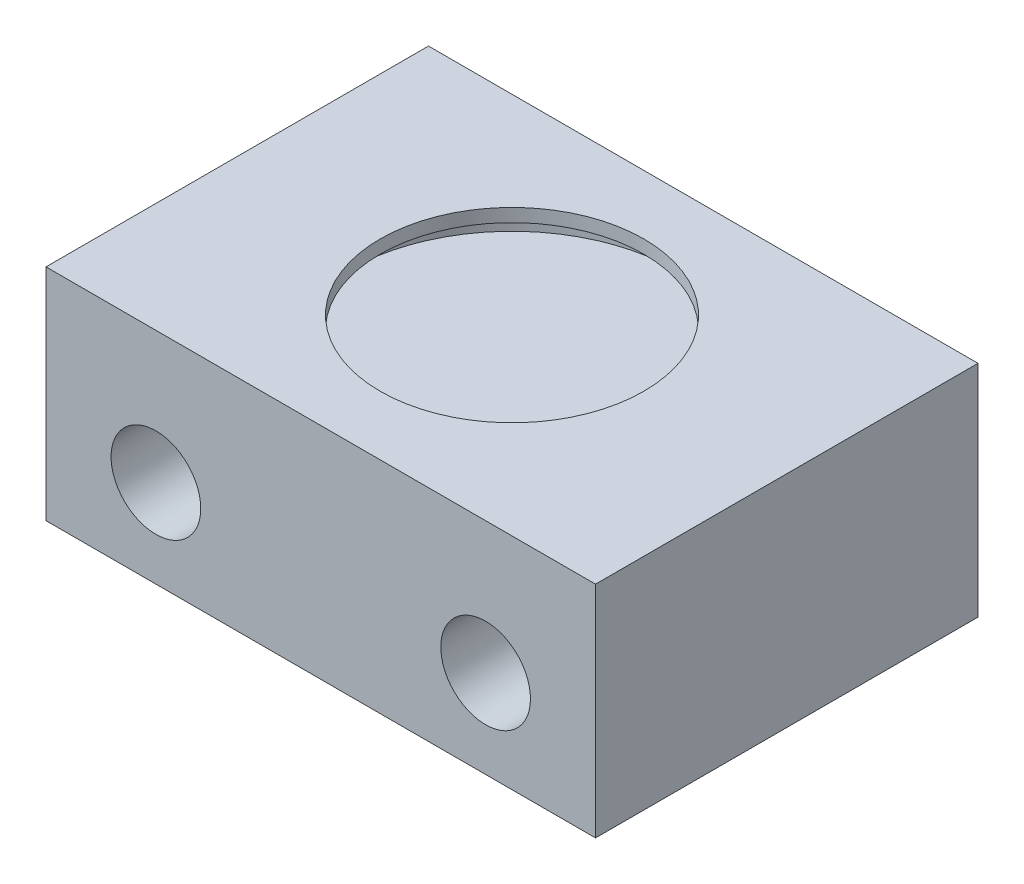
ISO-10303-21;
HEADER;
FILE_DESCRIPTION(('STEP AP214'),'2;1');
FILE_NAME('part.step','',(''),(''),'','','');
FILE_SCHEMA(('AUTOMOTIVE_DESIGN { 1 0 10303 214 1 1 1 1 }'));
ENDSEC;
DATA;
#1=APPLICATION_CONTEXT('core data for automotive mechanical design processes');
#2=APPLICATION_PROTOCOL_DEFINITION('international standard','automotive_design',2000,#1);
#3=PRODUCT_CONTEXT('',#1,'mechanical');
#4=PRODUCT('Part','Part','',(#3));
#5=PRODUCT_RELATED_PRODUCT_CATEGORY('part','',(#4));
#6=PRODUCT_DEFINITION_FORMATION('','',#4);
#7=PRODUCT_DEFINITION_CONTEXT('part definition',#1,'design');
#8=PRODUCT_DEFINITION('design','',#6,#7);
#9=PRODUCT_DEFINITION_SHAPE('','',#8);
#10=(LENGTH_UNIT() NAMED_UNIT(*) SI_UNIT(.MILLI.,.METRE.));
#11=(NAMED_UNIT(*) PLANE_ANGLE_UNIT() SI_UNIT($,.RADIAN.));
#12=(NAMED_UNIT(*) SI_UNIT($,.STERADIAN.) SOLID_ANGLE_UNIT());
#13=UNCERTAINTY_MEASURE_WITH_UNIT(LENGTH_MEASURE(1.E-05),#10,'distance_accuracy_value','');
#14=(GEOMETRIC_REPRESENTATION_CONTEXT(3) GLOBAL_UNCERTAINTY_ASSIGNED_CONTEXT((#13)) GLOBAL_UNIT_ASSIGNED_CONTEXT((#10,
#11,#12)) REPRESENTATION_CONTEXT('',''));
#15=CARTESIAN_POINT('',(0.,0.,0.));
#16=DIRECTION('',(0.,0.,1.));
#17=DIRECTION('',(1.,0.,0.));
#18=AXIS2_PLACEMENT_3D('',#15,#16,#17);
#19=CARTESIAN_POINT('',(15.875,12.7,-11.049));
#20=DIRECTION('',(-1.,0.,0.));
#21=DIRECTION('',(0.,0.,1.));
#22=AXIS2_PLACEMENT_3D('',#19,#20,#21);
#23=PLANE('',#22);
#24=DIRECTION('',(0.,0.,-1.));
#25=VECTOR('',#24,1.);
#26=CARTESIAN_POINT('',(15.875,0.,-11.049));
#27=LINE('',#26,#25);
#28=CARTESIAN_POINT('',(15.875,0.,11.049));
#29=VERTEX_POINT('',#28);
#30=CARTESIAN_POINT('',(15.875,0.,-11.049));
#31=VERTEX_POINT('',#30);
#32=EDGE_CURVE('E97',#29,#31,#27,.T.);
#33=ORIENTED_EDGE('',*,*,#32,.T.);
#34=DIRECTION('',(0.,-1.,0.));
#35=VECTOR('',#34,1.);
#36=CARTESIAN_POINT('',(15.875,12.7,-11.049));
#37=LINE('',#36,#35);
#38=CARTESIAN_POINT('',(15.875,12.7,-11.049));
#39=VERTEX_POINT('',#38);
#40=EDGE_CURVE('E11',#39,#31,#37,.T.);
#41=ORIENTED_EDGE('',*,*,#40,.F.);
#42=DIRECTION('',(0.,0.,-1.));
#43=VECTOR('',#42,1.);
#44=CARTESIAN_POINT('',(15.875,12.7,-11.049));
#45=LINE('',#44,#43);
#46=CARTESIAN_POINT('',(15.875,12.7,11.049));
#47=VERTEX_POINT('',#46);
#48=EDGE_CURVE('E85',#47,#39,#45,.T.);
#49=ORIENTED_EDGE('',*,*,#48,.F.);
#50=DIRECTION('',(0.,-1.,0.));
#51=VECTOR('',#50,1.);
#52=CARTESIAN_POINT('',(15.875,12.7,11.049));
#53=LINE('',#52,#51);
#54=EDGE_CURVE('E93',#47,#29,#53,.T.);
#55=ORIENTED_EDGE('',*,*,#54,.T.);
#56=EDGE_LOOP('',(#33,#41,#49,#55));
#57=FACE_BOUND('',#56,.T.);
#58=ADVANCED_FACE('F34',(#57),#23,.F.);
#59=CARTESIAN_POINT('',(-15.875,12.7,-11.049));
#60=DIRECTION('',(0.,0.,1.));
#61=DIRECTION('',(1.,0.,0.));
#62=AXIS2_PLACEMENT_3D('',#59,#60,#61);
#63=PLANE('',#62);
#64=CARTESIAN_POINT('',(-9.525,5.08,-11.049));
#65=DIRECTION('',(0.,0.,1.));
#66=DIRECTION('',(1.,0.,0.));
#67=AXIS2_PLACEMENT_3D('',#64,#65,#66);
#68=CIRCLE('',#67,2.5908);
#69=CARTESIAN_POINT('',(-6.93420000000001,5.08,-11.049));
#70=VERTEX_POINT('',#69);
#71=EDGE_CURVE('E122',#70,#70,#68,.T.);
#72=ORIENTED_EDGE('',*,*,#71,.T.);
#73=EDGE_LOOP('',(#72));
#74=FACE_BOUND('',#73,.T.);
#75=CARTESIAN_POINT('',(9.525,5.08,-11.049));
#76=DIRECTION('',(0.,0.,1.));
#77=DIRECTION('',(1.,0.,0.));
#78=AXIS2_PLACEMENT_3D('',#75,#76,#77);
#79=CIRCLE('',#78,2.5908);
#80=CARTESIAN_POINT('',(12.1158,5.08,-11.049));
#81=VERTEX_POINT('',#80);
#82=EDGE_CURVE('E114',#81,#81,#79,.T.);
#83=ORIENTED_EDGE('',*,*,#82,.T.);
#84=EDGE_LOOP('',(#83));
#85=FACE_BOUND('',#84,.T.);
#86=DIRECTION('',(-1.,0.,0.));
#87=VECTOR('',#86,1.);
#88=CARTESIAN_POINT('',(-15.875,0.,-11.049));
#89=LINE('',#88,#87);
#90=CARTESIAN_POINT('',(-15.875,0.,-11.049));
#91=VERTEX_POINT('',#90);
#92=EDGE_CURVE('E89',#31,#91,#89,.T.);
#93=ORIENTED_EDGE('',*,*,#92,.T.);
#94=DIRECTION('',(0.,-1.,0.));
#95=VECTOR('',#94,1.);
#96=CARTESIAN_POINT('',(-15.875,12.7,-11.049));
#97=LINE('',#96,#95);
#98=CARTESIAN_POINT('',(-15.875,12.7,-11.049));
#99=VERTEX_POINT('',#98);
#100=EDGE_CURVE('E42',#99,#91,#97,.T.);
#101=ORIENTED_EDGE('',*,*,#100,.F.);
#102=DIRECTION('',(-1.,0.,0.));
#103=VECTOR('',#102,1.);
#104=CARTESIAN_POINT('',(-15.875,12.7,-11.049));
#105=LINE('',#104,#103);
#106=EDGE_CURVE('E80',#39,#99,#105,.T.);
#107=ORIENTED_EDGE('',*,*,#106,.F.);
#108=ORIENTED_EDGE('',*,*,#40,.T.);
#109=EDGE_LOOP('',(#93,#101,#107,#108));
#110=FACE_BOUND('',#109,.T.);
#111=ADVANCED_FACE('F88',(#74,#85,#110),#63,.F.);
#112=CARTESIAN_POINT('',(-15.875,12.7,-11.049));
#113=DIRECTION('',(1.,0.,0.));
#114=DIRECTION('',(0.,0.,-1.));
#115=AXIS2_PLACEMENT_3D('',#112,#113,#114);
#116=PLANE('',#115);
#117=DIRECTION('',(0.,0.,1.));
#118=VECTOR('',#117,1.);
#119=CARTESIAN_POINT('',(-15.875,0.,-11.049));
#120=LINE('',#119,#118);
#121=CARTESIAN_POINT('',(-15.875,0.,11.049));
#122=VERTEX_POINT('',#121);
#123=EDGE_CURVE('E67',#91,#122,#120,.T.);
#124=ORIENTED_EDGE('',*,*,#123,.T.);
#125=DIRECTION('',(0.,-1.,0.));
#126=VECTOR('',#125,1.);
#127=CARTESIAN_POINT('',(-15.875,12.7,11.049));
#128=LINE('',#127,#126);
#129=CARTESIAN_POINT('',(-15.875,12.7,11.049));
#130=VERTEX_POINT('',#129);
#131=EDGE_CURVE('E90',#130,#122,#128,.T.);
#132=ORIENTED_EDGE('',*,*,#131,.F.);
#133=DIRECTION('',(0.,0.,1.));
#134=VECTOR('',#133,1.);
#135=CARTESIAN_POINT('',(-15.875,12.7,-11.049));
#136=LINE('',#135,#134);
#137=EDGE_CURVE('E83',#99,#130,#136,.T.);
#138=ORIENTED_EDGE('',*,*,#137,.F.);
#139=ORIENTED_EDGE('',*,*,#100,.T.);
#140=EDGE_LOOP('',(#124,#132,#138,#139));
#141=FACE_BOUND('',#140,.T.);
#142=ADVANCED_FACE('F91',(#141),#116,.F.);
#143=CARTESIAN_POINT('',(-15.875,12.7,11.049));
#144=DIRECTION('',(0.,0.,-1.));
#145=DIRECTION('',(-1.,0.,0.));
#146=AXIS2_PLACEMENT_3D('',#143,#144,#145);
#147=PLANE('',#146);
#148=CARTESIAN_POINT('',(-9.525,5.08,11.049));
#149=DIRECTION('',(0.,0.,1.));
#150=DIRECTION('',(1.,0.,0.));
#151=AXIS2_PLACEMENT_3D('',#148,#149,#150);
#152=CIRCLE('',#151,2.5908);
#153=CARTESIAN_POINT('',(-6.9342,5.08,11.049));
#154=VERTEX_POINT('',#153);
#155=EDGE_CURVE('E125',#154,#154,#152,.T.);
#156=ORIENTED_EDGE('',*,*,#155,.F.);
#157=EDGE_LOOP('',(#156));
#158=FACE_BOUND('',#157,.T.);
#159=CARTESIAN_POINT('',(9.525,5.08,11.049));
#160=DIRECTION('',(0.,0.,1.));
#161=DIRECTION('',(1.,0.,0.));
#162=AXIS2_PLACEMENT_3D('',#159,#160,#161);
#163=CIRCLE('',#162,2.5908);
#164=CARTESIAN_POINT('',(12.1158,5.08,11.049));
#165=VERTEX_POINT('',#164);
#166=EDGE_CURVE('E119',#165,#165,#163,.T.);
#167=ORIENTED_EDGE('',*,*,#166,.F.);
#168=EDGE_LOOP('',(#167));
#169=FACE_BOUND('',#168,.T.);
#170=DIRECTION('',(1.,0.,0.));
#171=VECTOR('',#170,1.);
#172=CARTESIAN_POINT('',(-15.875,0.,11.049));
#173=LINE('',#172,#171);
#174=EDGE_CURVE('E73',#122,#29,#173,.T.);
#175=ORIENTED_EDGE('',*,*,#174,.T.);
#176=ORIENTED_EDGE('',*,*,#54,.F.);
#177=DIRECTION('',(1.,0.,0.));
#178=VECTOR('',#177,1.);
#179=CARTESIAN_POINT('',(-15.875,12.7,11.049));
#180=LINE('',#179,#178);
#181=EDGE_CURVE('E50',#130,#47,#180,.T.);
#182=ORIENTED_EDGE('',*,*,#181,.F.);
#183=ORIENTED_EDGE('',*,*,#131,.T.);
#184=EDGE_LOOP('',(#175,#176,#182,#183));
#185=FACE_BOUND('',#184,.T.);
#186=ADVANCED_FACE('F105',(#158,#169,#185),#147,.F.);
#187=CARTESIAN_POINT('',(0.,12.7,0.));
#188=DIRECTION('',(0.,1.,0.));
#189=DIRECTION('',(0.,0.,1.));
#190=AXIS2_PLACEMENT_3D('',#187,#188,#189);
#191=PLANE('',#190);
#192=CARTESIAN_POINT('',(0.,12.7,0.));
#193=DIRECTION('',(0.,1.,0.));
#194=DIRECTION('',(0.,0.,1.));
#195=AXIS2_PLACEMENT_3D('',#192,#193,#194);
#196=CIRCLE('',#195,7.62);
#197=CARTESIAN_POINT('',(0.,12.7,7.62));
#198=VERTEX_POINT('',#197);
#199=EDGE_CURVE('E128',#198,#198,#196,.T.);
#200=ORIENTED_EDGE('',*,*,#199,.F.);
#201=EDGE_LOOP('',(#200));
#202=FACE_BOUND('',#201,.T.);
#203=ORIENTED_EDGE('',*,*,#48,.T.);
#204=ORIENTED_EDGE('',*,*,#106,.T.);
#205=ORIENTED_EDGE('',*,*,#137,.T.);
#206=ORIENTED_EDGE('',*,*,#181,.T.);
#207=EDGE_LOOP('',(#203,#204,#205,#206));
#208=FACE_BOUND('',#207,.T.);
#209=ADVANCED_FACE('F81',(#202,#208),#191,.T.);
#210=CARTESIAN_POINT('',(0.,0.,0.));
#211=DIRECTION('',(0.,1.,0.));
#212=DIRECTION('',(0.,0.,1.));
#213=AXIS2_PLACEMENT_3D('',#210,#211,#212);
#214=PLANE('',#213);
#215=ORIENTED_EDGE('',*,*,#32,.F.);
#216=ORIENTED_EDGE('',*,*,#174,.F.);
#217=ORIENTED_EDGE('',*,*,#123,.F.);
#218=ORIENTED_EDGE('',*,*,#92,.F.);
#219=EDGE_LOOP('',(#215,#216,#217,#218));
#220=FACE_BOUND('',#219,.T.);
#221=ADVANCED_FACE('F108',(#220),#214,.F.);
#222=CARTESIAN_POINT('',(9.525,5.08,11.049));
#223=DIRECTION('',(0.,0.,1.));
#224=DIRECTION('',(1.,0.,0.));
#225=AXIS2_PLACEMENT_3D('',#222,#223,#224);
#226=CYLINDRICAL_SURFACE('',#225,2.5908);
#227=ORIENTED_EDGE('',*,*,#82,.F.);
#228=EDGE_LOOP('',(#227));
#229=FACE_BOUND('',#228,.T.);
#230=ORIENTED_EDGE('',*,*,#166,.T.);
#231=EDGE_LOOP('',(#230));
#232=FACE_BOUND('',#231,.T.);
#233=ADVANCED_FACE('F170',(#229,#232),#226,.F.);
#234=CARTESIAN_POINT('',(-9.525,5.08,11.049));
#235=DIRECTION('',(0.,0.,1.));
#236=DIRECTION('',(1.,0.,0.));
#237=AXIS2_PLACEMENT_3D('',#234,#235,#236);
#238=CYLINDRICAL_SURFACE('',#237,2.5908);
#239=ORIENTED_EDGE('',*,*,#71,.F.);
#240=EDGE_LOOP('',(#239));
#241=FACE_BOUND('',#240,.T.);
#242=ORIENTED_EDGE('',*,*,#155,.T.);
#243=EDGE_LOOP('',(#242));
#244=FACE_BOUND('',#243,.T.);
#245=ADVANCED_FACE('F178',(#241,#244),#238,.F.);
#246=CARTESIAN_POINT('',(0.,-0.000999999999999265,0.));
#247=DIRECTION('',(0.,1.,0.));
#248=DIRECTION('',(0.,0.,1.));
#249=AXIS2_PLACEMENT_3D('',#246,#247,#248);
#250=CYLINDRICAL_SURFACE('',#249,7.62);
#251=ORIENTED_EDGE('',*,*,#199,.T.);
#252=EDGE_LOOP('',(#251));
#253=FACE_BOUND('',#252,.T.);
#254=CARTESIAN_POINT('',(0.,11.938,0.));
#255=DIRECTION('',(0.,1.,0.));
#256=DIRECTION('',(0.,0.,1.));
#257=AXIS2_PLACEMENT_3D('',#254,#255,#256);
#258=CIRCLE('',#257,7.62);
#259=CARTESIAN_POINT('',(0.,11.938,7.62));
#260=VERTEX_POINT('',#259);
#261=EDGE_CURVE('E131',#260,#260,#258,.F.);
#262=ORIENTED_EDGE('',*,*,#261,.T.);
#263=EDGE_LOOP('',(#262));
#264=FACE_BOUND('',#263,.T.);
#265=ADVANCED_FACE('F135',(#253,#264),#250,.F.);
#266=CARTESIAN_POINT('',(0.,11.938,0.));
#267=DIRECTION('',(0.,-1.,0.));
#268=DIRECTION('',(0.,0.,-1.));
#269=AXIS2_PLACEMENT_3D('',#266,#267,#268);
#270=CYLINDRICAL_SURFACE('',#269,9.525);
#271=CARTESIAN_POINT('',(0.,11.938,0.));
#272=DIRECTION('',(0.,1.,0.));
#273=DIRECTION('',(0.,0.,1.));
#274=AXIS2_PLACEMENT_3D('',#271,#272,#273);
#275=CIRCLE('',#274,9.525);
#276=CARTESIAN_POINT('',(0.,11.938,9.525));
#277=VERTEX_POINT('',#276);
#278=EDGE_CURVE('E100',#277,#277,#275,.T.);
#279=ORIENTED_EDGE('',*,*,#278,.T.);
#280=EDGE_LOOP('',(#279));
#281=FACE_BOUND('',#280,.T.);
#282=CARTESIAN_POINT('',(0.,10.16,0.));
#283=DIRECTION('',(0.,1.,0.));
#284=DIRECTION('',(0.,0.,1.));
#285=AXIS2_PLACEMENT_3D('',#282,#283,#284);
#286=CIRCLE('',#285,9.525);
#287=CARTESIAN_POINT('',(0.,10.16,9.525));
#288=VERTEX_POINT('',#287);
#289=EDGE_CURVE('E111',#288,#288,#286,.T.);
#290=ORIENTED_EDGE('',*,*,#289,.F.);
#291=EDGE_LOOP('',(#290));
#292=FACE_BOUND('',#291,.T.);
#293=ADVANCED_FACE('F141',(#281,#292),#270,.F.);
#294=CARTESIAN_POINT('',(0.,11.938,0.));
#295=DIRECTION('',(0.,1.,0.));
#296=DIRECTION('',(0.,0.,1.));
#297=AXIS2_PLACEMENT_3D('',#294,#295,#296);
#298=PLANE('',#297);
#299=ORIENTED_EDGE('',*,*,#261,.F.);
#300=EDGE_LOOP('',(#299));
#301=FACE_BOUND('',#300,.T.);
#302=ORIENTED_EDGE('',*,*,#278,.F.);
#303=EDGE_LOOP('',(#302));
#304=FACE_BOUND('',#303,.T.);
#305=ADVANCED_FACE('F137',(#301,#304),#298,.F.);
#306=CARTESIAN_POINT('',(0.,10.16,0.));
#307=DIRECTION('',(0.,1.,0.));
#308=DIRECTION('',(0.,0.,1.));
#309=AXIS2_PLACEMENT_3D('',#306,#307,#308);
#310=PLANE('',#309);
#311=ORIENTED_EDGE('',*,*,#289,.T.);
#312=EDGE_LOOP('',(#311));
#313=FACE_BOUND('',#312,.T.);
#314=ADVANCED_FACE('F140',(#313),#310,.T.);
#315=CLOSED_SHELL('',(#58,#111,#142,#186,#209,#221,#233,#245,#265,#293,#305,#314));
#316=MANIFOLD_SOLID_BREP('B2',#315);
#317=ADVANCED_BREP_SHAPE_REPRESENTATION('',(#18,#316),#14);
#318=SHAPE_DEFINITION_REPRESENTATION(#9,#317);
ENDSEC;
END-ISO-10303-21;
